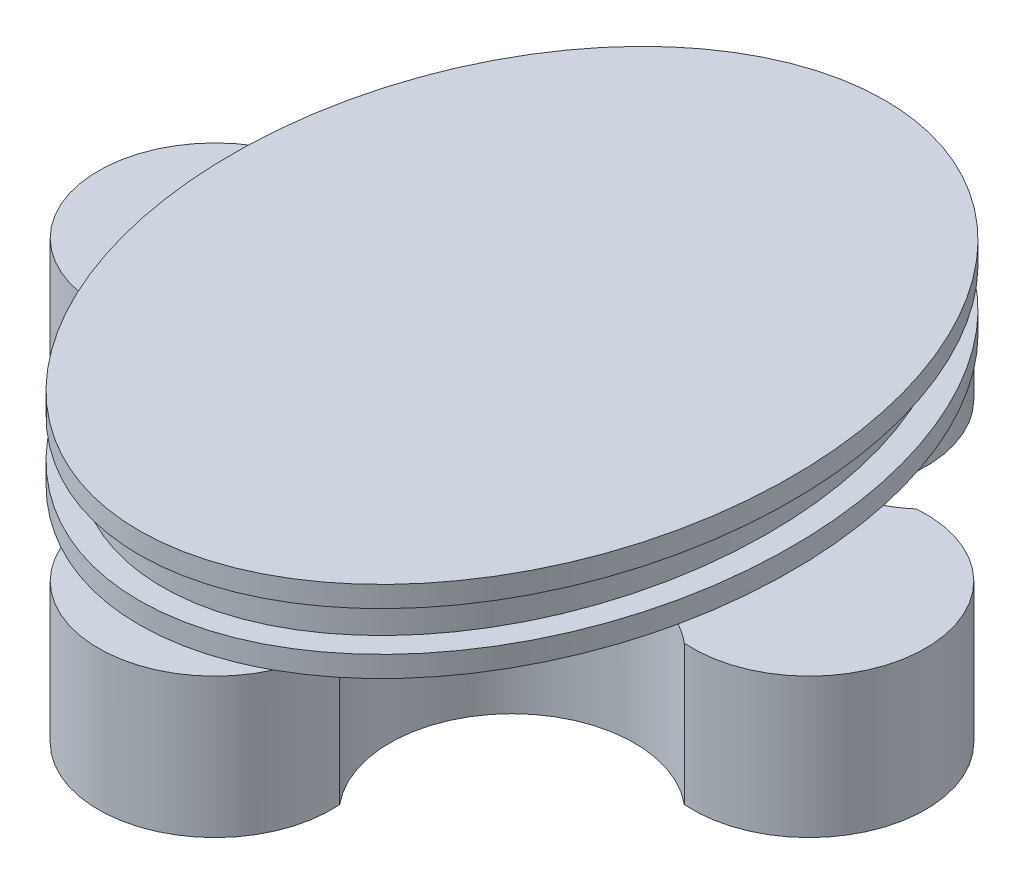
ISO-10303-21;
HEADER;
FILE_DESCRIPTION(('STEP AP214'),'2;1');
FILE_NAME('part.step','',(''),(''),'','','');
FILE_SCHEMA(('AUTOMOTIVE_DESIGN { 1 0 10303 214 1 1 1 1 }'));
ENDSEC;
DATA;
#1=APPLICATION_CONTEXT('core data for automotive mechanical design processes');
#2=APPLICATION_PROTOCOL_DEFINITION('international standard','automotive_design',2000,#1);
#3=PRODUCT_CONTEXT('',#1,'mechanical');
#4=PRODUCT('Part','Part','',(#3));
#5=PRODUCT_RELATED_PRODUCT_CATEGORY('part','',(#4));
#6=PRODUCT_DEFINITION_FORMATION('','',#4);
#7=PRODUCT_DEFINITION_CONTEXT('part definition',#1,'design');
#8=PRODUCT_DEFINITION('design','',#6,#7);
#9=PRODUCT_DEFINITION_SHAPE('','',#8);
#10=(LENGTH_UNIT() NAMED_UNIT(*) SI_UNIT(.MILLI.,.METRE.));
#11=(NAMED_UNIT(*) PLANE_ANGLE_UNIT() SI_UNIT($,.RADIAN.));
#12=(NAMED_UNIT(*) SI_UNIT($,.STERADIAN.) SOLID_ANGLE_UNIT());
#13=UNCERTAINTY_MEASURE_WITH_UNIT(LENGTH_MEASURE(1.E-05),#10,'distance_accuracy_value','');
#14=(GEOMETRIC_REPRESENTATION_CONTEXT(3) GLOBAL_UNCERTAINTY_ASSIGNED_CONTEXT((#13)) GLOBAL_UNIT_ASSIGNED_CONTEXT((#10,
#11,#12)) REPRESENTATION_CONTEXT('',''));
#15=CARTESIAN_POINT('',(0.,0.,0.));
#16=DIRECTION('',(0.,0.,1.));
#17=DIRECTION('',(1.,0.,0.));
#18=AXIS2_PLACEMENT_3D('',#15,#16,#17);
#19=CARTESIAN_POINT('',(0.,0.,0.));
#20=DIRECTION('',(0.,1.,0.));
#21=DIRECTION('',(0.,0.,1.));
#22=AXIS2_PLACEMENT_3D('',#19,#20,#21);
#23=PLANE('',#22);
#24=CARTESIAN_POINT('',(0.,0.,0.));
#25=DIRECTION('',(0.,1.,0.));
#26=DIRECTION('',(0.,0.,-1.));
#27=AXIS2_PLACEMENT_3D('',#24,#25,#26);
#28=ELLIPSE('',#27,16.,12.);
#29=CARTESIAN_POINT('',(-11.5350552187258,0.,4.41059353041869));
#30=VERTEX_POINT('',#29);
#31=CARTESIAN_POINT('',(-4.56069619587107,0.,14.799402402888));
#32=VERTEX_POINT('',#31);
#33=EDGE_CURVE('E251',#30,#32,#28,.T.);
#34=ORIENTED_EDGE('',*,*,#33,.F.);
#35=CARTESIAN_POINT('',(-9.01499999999982,0.,9.01622287878911));
#36=DIRECTION('',(0.,-1.,0.));
#37=DIRECTION('',(0.,0.,-1.));
#38=AXIS2_PLACEMENT_3D('',#35,#36,#37);
#39=CIRCLE('',#38,5.2499999999999);
#40=CARTESIAN_POINT('',(-4.9864961665555,0.,12.3827725760197));
#41=VERTEX_POINT('',#40);
#42=EDGE_CURVE('E53',#30,#41,#39,.T.);
#43=ORIENTED_EDGE('',*,*,#42,.T.);
#44=CARTESIAN_POINT('',(2.5381832073261E-13,0.,12.75));
#45=DIRECTION('',(0.,-1.,0.));
#46=DIRECTION('',(0.,0.,-1.));
#47=AXIS2_PLACEMENT_3D('',#44,#45,#46);
#48=CIRCLE('',#47,4.99999999999984);
#49=EDGE_CURVE('E204',#32,#41,#48,.T.);
#50=ORIENTED_EDGE('',*,*,#49,.F.);
#51=EDGE_LOOP('',(#34,#43,#50));
#52=FACE_BOUND('',#51,.T.);
#53=ADVANCED_FACE('F42',(#52),#23,.F.);
#54=CARTESIAN_POINT('',(0.,0.,-12.75));
#55=DIRECTION('',(0.,-1.,0.));
#56=DIRECTION('',(0.,0.,-1.));
#57=AXIS2_PLACEMENT_3D('',#54,#55,#56);
#58=CIRCLE('',#57,5.);
#59=CARTESIAN_POINT('',(-4.98627820309729,0.,-12.3798247964586));
#60=VERTEX_POINT('',#59);
#61=CARTESIAN_POINT('',(-4.56069619587164,0.,-14.7994024028877));
#62=VERTEX_POINT('',#61);
#63=EDGE_CURVE('E182',#60,#62,#58,.T.);
#64=ORIENTED_EDGE('',*,*,#63,.F.);
#65=CARTESIAN_POINT('',(-9.01622287878913,0.,-9.01499999999997));
#66=DIRECTION('',(0.,-1.,0.));
#67=DIRECTION('',(0.,0.,-1.));
#68=AXIS2_PLACEMENT_3D('',#65,#66,#67);
#69=CIRCLE('',#68,5.25);
#70=CARTESIAN_POINT('',(-11.5354192149795,0.,-4.40890080222699));
#71=VERTEX_POINT('',#70);
#72=EDGE_CURVE('E144',#60,#71,#69,.T.);
#73=ORIENTED_EDGE('',*,*,#72,.T.);
#74=EDGE_CURVE('E241',#62,#71,#28,.T.);
#75=ORIENTED_EDGE('',*,*,#74,.F.);
#76=EDGE_LOOP('',(#64,#73,#75));
#77=FACE_BOUND('',#76,.T.);
#78=ADVANCED_FACE('F307',(#77),#23,.F.);
#79=CARTESIAN_POINT('',(4.98627820309738,0.,12.3798247964586));
#80=VERTEX_POINT('',#79);
#81=CARTESIAN_POINT('',(4.56069619587174,0.,14.7994024028877));
#82=VERTEX_POINT('',#81);
#83=EDGE_CURVE('E199',#80,#82,#48,.T.);
#84=ORIENTED_EDGE('',*,*,#83,.F.);
#85=CARTESIAN_POINT('',(9.01622287878919,0.,9.01499999999991));
#86=DIRECTION('',(0.,-1.,0.));
#87=DIRECTION('',(0.,0.,-1.));
#88=AXIS2_PLACEMENT_3D('',#85,#86,#87);
#89=CIRCLE('',#88,5.25);
#90=CARTESIAN_POINT('',(11.5354192149795,0.,4.4089008022269));
#91=VERTEX_POINT('',#90);
#92=EDGE_CURVE('E194',#80,#91,#89,.T.);
#93=ORIENTED_EDGE('',*,*,#92,.T.);
#94=EDGE_CURVE('E262',#82,#91,#28,.T.);
#95=ORIENTED_EDGE('',*,*,#94,.F.);
#96=EDGE_LOOP('',(#84,#93,#95));
#97=FACE_BOUND('',#96,.T.);
#98=ADVANCED_FACE('F311',(#97),#23,.F.);
#99=CARTESIAN_POINT('',(0.,0.9,0.));
#100=DIRECTION('',(0.,1.,0.));
#101=DIRECTION('',(0.,0.,-1.));
#102=AXIS2_PLACEMENT_3D('',#99,#100,#101);
#103=ELLIPSE('',#102,16.,12.);
#104=DIRECTION('',(0.,-1.,0.));
#105=VECTOR('',#104,1.);
#106=SURFACE_OF_LINEAR_EXTRUSION('',#103,#105);
#107=CARTESIAN_POINT('',(0.,0.9,-16.));
#108=VERTEX_POINT('',#107);
#109=EDGE_CURVE('E237',#108,#108,#103,.T.);
#110=ORIENTED_EDGE('',*,*,#109,.F.);
#111=EDGE_LOOP('',(#110));
#112=FACE_BOUND('',#111,.T.);
#113=ORIENTED_EDGE('',*,*,#74,.T.);
#114=EDGE_CURVE('E244',#71,#30,#28,.T.);
#115=ORIENTED_EDGE('',*,*,#114,.T.);
#116=ORIENTED_EDGE('',*,*,#33,.T.);
#117=EDGE_CURVE('E266',#32,#82,#28,.T.);
#118=ORIENTED_EDGE('',*,*,#117,.T.);
#119=ORIENTED_EDGE('',*,*,#94,.T.);
#120=CARTESIAN_POINT('',(11.5350552187259,0.,-4.41059353041851));
#121=VERTEX_POINT('',#120);
#122=EDGE_CURVE('E257',#91,#121,#28,.T.);
#123=ORIENTED_EDGE('',*,*,#122,.T.);
#124=CARTESIAN_POINT('',(4.56069619587164,0.,-14.7994024028877));
#125=VERTEX_POINT('',#124);
#126=EDGE_CURVE('E253',#121,#125,#28,.T.);
#127=ORIENTED_EDGE('',*,*,#126,.T.);
#128=EDGE_CURVE('E152',#125,#62,#28,.T.);
#129=ORIENTED_EDGE('',*,*,#128,.T.);
#130=EDGE_LOOP('',(#113,#115,#116,#118,#119,#123,#127,#129));
#131=FACE_BOUND('',#130,.T.);
#132=ADVANCED_FACE('F44',(#112,#131),#106,.F.);
#133=CARTESIAN_POINT('',(0.,0.9,0.));
#134=DIRECTION('',(0.,1.,0.));
#135=DIRECTION('',(0.,0.,1.));
#136=AXIS2_PLACEMENT_3D('',#133,#134,#135);
#137=PLANE('',#136);
#138=CARTESIAN_POINT('',(0.,0.9,0.));
#139=DIRECTION('',(0.,1.,0.));
#140=DIRECTION('',(0.,0.,-1.));
#141=AXIS2_PLACEMENT_3D('',#138,#139,#140);
#142=ELLIPSE('',#141,15.,11.);
#143=CARTESIAN_POINT('',(0.,0.9,-15.));
#144=VERTEX_POINT('',#143);
#145=EDGE_CURVE('E11',#144,#144,#142,.T.);
#146=ORIENTED_EDGE('',*,*,#145,.F.);
#147=EDGE_LOOP('',(#146));
#148=FACE_BOUND('',#147,.T.);
#149=ORIENTED_EDGE('',*,*,#109,.T.);
#150=EDGE_LOOP('',(#149));
#151=FACE_BOUND('',#150,.T.);
#152=ADVANCED_FACE('F315',(#148,#151),#137,.T.);
#153=CARTESIAN_POINT('',(4.98649616655595,0.,-12.3827725760202));
#154=VERTEX_POINT('',#153);
#155=EDGE_CURVE('E150',#125,#154,#58,.T.);
#156=ORIENTED_EDGE('',*,*,#155,.F.);
#157=ORIENTED_EDGE('',*,*,#126,.F.);
#158=CARTESIAN_POINT('',(9.015,0.,-9.0162228787891));
#159=DIRECTION('',(0.,-1.,0.));
#160=DIRECTION('',(0.,0.,-1.));
#161=AXIS2_PLACEMENT_3D('',#158,#159,#160);
#162=CIRCLE('',#161,5.25);
#163=EDGE_CURVE('E66',#121,#154,#162,.T.);
#164=ORIENTED_EDGE('',*,*,#163,.T.);
#165=EDGE_LOOP('',(#156,#157,#164));
#166=FACE_BOUND('',#165,.T.);
#167=ADVANCED_FACE('F302',(#166),#23,.F.);
#168=CARTESIAN_POINT('',(0.,0.,0.));
#169=DIRECTION('',(0.,-1.,0.));
#170=DIRECTION('',(0.,0.,-1.));
#171=AXIS2_PLACEMENT_3D('',#168,#169,#170);
#172=PLANE('',#171);
#173=ORIENTED_EDGE('',*,*,#114,.F.);
#174=CARTESIAN_POINT('',(-12.3827725760202,0.,-4.9864961665559));
#175=VERTEX_POINT('',#174);
#176=EDGE_CURVE('E212',#71,#175,#69,.T.);
#177=ORIENTED_EDGE('',*,*,#176,.T.);
#178=CARTESIAN_POINT('',(-12.75,0.,0.));
#179=DIRECTION('',(0.,-1.,0.));
#180=DIRECTION('',(0.,0.,-1.));
#181=AXIS2_PLACEMENT_3D('',#178,#179,#180);
#182=CIRCLE('',#181,5.);
#183=CARTESIAN_POINT('',(-12.3798247964584,0.,4.98627820309731));
#184=VERTEX_POINT('',#183);
#185=EDGE_CURVE('E208',#184,#175,#182,.T.);
#186=ORIENTED_EDGE('',*,*,#185,.F.);
#187=EDGE_CURVE('E203',#184,#30,#39,.T.);
#188=ORIENTED_EDGE('',*,*,#187,.T.);
#189=EDGE_LOOP('',(#173,#177,#186,#188));
#190=FACE_BOUND('',#189,.T.);
#191=ADVANCED_FACE('F294',(#190),#172,.F.);
#192=ORIENTED_EDGE('',*,*,#117,.F.);
#193=EDGE_CURVE('E198',#82,#32,#48,.T.);
#194=ORIENTED_EDGE('',*,*,#193,.F.);
#195=EDGE_LOOP('',(#192,#194));
#196=FACE_BOUND('',#195,.T.);
#197=ADVANCED_FACE('F291',(#196),#172,.F.);
#198=ORIENTED_EDGE('',*,*,#122,.F.);
#199=CARTESIAN_POINT('',(12.3827725760202,0.,4.98649616655582));
#200=VERTEX_POINT('',#199);
#201=EDGE_CURVE('E193',#91,#200,#89,.T.);
#202=ORIENTED_EDGE('',*,*,#201,.T.);
#203=CARTESIAN_POINT('',(12.75,0.,-1.3354916121075E-13));
#204=DIRECTION('',(0.,-1.,0.));
#205=DIRECTION('',(0.,0.,-1.));
#206=AXIS2_PLACEMENT_3D('',#203,#204,#205);
#207=CIRCLE('',#206,5.);
#208=CARTESIAN_POINT('',(12.3798247964589,0.,-4.98627820309744));
#209=VERTEX_POINT('',#208);
#210=EDGE_CURVE('E189',#209,#200,#207,.T.);
#211=ORIENTED_EDGE('',*,*,#210,.F.);
#212=EDGE_CURVE('E185',#209,#121,#162,.T.);
#213=ORIENTED_EDGE('',*,*,#212,.T.);
#214=EDGE_LOOP('',(#198,#202,#211,#213));
#215=FACE_BOUND('',#214,.T.);
#216=ADVANCED_FACE('F293',(#215),#172,.F.);
#217=CARTESIAN_POINT('',(0.,-6.,-12.75));
#218=DIRECTION('',(0.,1.,0.));
#219=DIRECTION('',(0.,0.,1.));
#220=AXIS2_PLACEMENT_3D('',#217,#218,#219);
#221=CYLINDRICAL_SURFACE('',#220,5.);
#222=ORIENTED_EDGE('',*,*,#63,.T.);
#223=EDGE_CURVE('E186',#62,#125,#58,.T.);
#224=ORIENTED_EDGE('',*,*,#223,.T.);
#225=ORIENTED_EDGE('',*,*,#155,.T.);
#226=DIRECTION('',(0.,1.,0.));
#227=VECTOR('',#226,1.);
#228=CARTESIAN_POINT('',(4.98649616655595,-6.,-12.3827725760202));
#229=LINE('',#228,#227);
#230=CARTESIAN_POINT('',(4.98649616655595,-6.,-12.3827725760202));
#231=VERTEX_POINT('',#230);
#232=EDGE_CURVE('E61',#231,#154,#229,.T.);
#233=ORIENTED_EDGE('',*,*,#232,.F.);
#234=CARTESIAN_POINT('',(0.,-6.,-12.75));
#235=DIRECTION('',(0.,-1.,0.));
#236=DIRECTION('',(0.,0.,-1.));
#237=AXIS2_PLACEMENT_3D('',#234,#235,#236);
#238=CIRCLE('',#237,5.);
#239=CARTESIAN_POINT('',(-4.98627820309729,-6.,-12.3798247964586));
#240=VERTEX_POINT('',#239);
#241=EDGE_CURVE('E137',#240,#231,#238,.T.);
#242=ORIENTED_EDGE('',*,*,#241,.F.);
#243=DIRECTION('',(0.,1.,0.));
#244=VECTOR('',#243,1.);
#245=CARTESIAN_POINT('',(-4.98627820309729,-6.,-12.3798247964586));
#246=LINE('',#245,#244);
#247=EDGE_CURVE('E181',#240,#60,#246,.T.);
#248=ORIENTED_EDGE('',*,*,#247,.T.);
#249=EDGE_LOOP('',(#222,#224,#225,#233,#242,#248));
#250=FACE_BOUND('',#249,.T.);
#251=ADVANCED_FACE('F147',(#250),#221,.T.);
#252=CARTESIAN_POINT('',(9.015,-6.,-9.0162228787891));
#253=DIRECTION('',(0.,1.,0.));
#254=DIRECTION('',(0.,0.,1.));
#255=AXIS2_PLACEMENT_3D('',#252,#253,#254);
#256=CYLINDRICAL_SURFACE('',#255,5.25);
#257=ORIENTED_EDGE('',*,*,#212,.F.);
#258=DIRECTION('',(0.,1.,0.));
#259=VECTOR('',#258,1.);
#260=CARTESIAN_POINT('',(12.3798247964589,-6.,-4.98627820309744));
#261=LINE('',#260,#259);
#262=CARTESIAN_POINT('',(12.3798247964589,-6.,-4.98627820309744));
#263=VERTEX_POINT('',#262);
#264=EDGE_CURVE('E153',#263,#209,#261,.T.);
#265=ORIENTED_EDGE('',*,*,#264,.F.);
#266=CARTESIAN_POINT('',(9.015,-6.,-9.0162228787891));
#267=DIRECTION('',(0.,-1.,0.));
#268=DIRECTION('',(0.,0.,-1.));
#269=AXIS2_PLACEMENT_3D('',#266,#267,#268);
#270=CIRCLE('',#269,5.25);
#271=EDGE_CURVE('E139',#263,#231,#270,.T.);
#272=ORIENTED_EDGE('',*,*,#271,.T.);
#273=ORIENTED_EDGE('',*,*,#232,.T.);
#274=ORIENTED_EDGE('',*,*,#163,.F.);
#275=EDGE_LOOP('',(#257,#265,#272,#273,#274));
#276=FACE_BOUND('',#275,.T.);
#277=ADVANCED_FACE('F155',(#276),#256,.F.);
#278=CARTESIAN_POINT('',(12.75,-6.,-1.3354916121075E-13));
#279=DIRECTION('',(0.,1.,0.));
#280=DIRECTION('',(0.,0.,1.));
#281=AXIS2_PLACEMENT_3D('',#278,#279,#280);
#282=CYLINDRICAL_SURFACE('',#281,5.);
#283=ORIENTED_EDGE('',*,*,#210,.T.);
#284=DIRECTION('',(0.,1.,0.));
#285=VECTOR('',#284,1.);
#286=CARTESIAN_POINT('',(12.3827725760202,-6.,4.98649616655582));
#287=LINE('',#286,#285);
#288=CARTESIAN_POINT('',(12.3827725760202,-6.,4.98649616655582));
#289=VERTEX_POINT('',#288);
#290=EDGE_CURVE('E232',#289,#200,#287,.T.);
#291=ORIENTED_EDGE('',*,*,#290,.F.);
#292=CARTESIAN_POINT('',(12.75,-6.,-1.3354916121075E-13));
#293=DIRECTION('',(0.,-1.,0.));
#294=DIRECTION('',(0.,0.,-1.));
#295=AXIS2_PLACEMENT_3D('',#292,#293,#294);
#296=CIRCLE('',#295,5.);
#297=EDGE_CURVE('E158',#263,#289,#296,.T.);
#298=ORIENTED_EDGE('',*,*,#297,.F.);
#299=ORIENTED_EDGE('',*,*,#264,.T.);
#300=EDGE_LOOP('',(#283,#291,#298,#299));
#301=FACE_BOUND('',#300,.T.);
#302=ADVANCED_FACE('F516',(#301),#282,.T.);
#303=CARTESIAN_POINT('',(9.01622287878919,-6.,9.01499999999991));
#304=DIRECTION('',(0.,1.,0.));
#305=DIRECTION('',(0.,0.,1.));
#306=AXIS2_PLACEMENT_3D('',#303,#304,#305);
#307=CYLINDRICAL_SURFACE('',#306,5.25);
#308=ORIENTED_EDGE('',*,*,#92,.F.);
#309=DIRECTION('',(0.,1.,0.));
#310=VECTOR('',#309,1.);
#311=CARTESIAN_POINT('',(4.98627820309738,-6.,12.3798247964586));
#312=LINE('',#311,#310);
#313=CARTESIAN_POINT('',(4.98627820309738,-6.,12.3798247964586));
#314=VERTEX_POINT('',#313);
#315=EDGE_CURVE('E229',#314,#80,#312,.T.);
#316=ORIENTED_EDGE('',*,*,#315,.F.);
#317=CARTESIAN_POINT('',(9.01622287878919,-6.,9.01499999999991));
#318=DIRECTION('',(0.,-1.,0.));
#319=DIRECTION('',(0.,0.,-1.));
#320=AXIS2_PLACEMENT_3D('',#317,#318,#319);
#321=CIRCLE('',#320,5.25);
#322=EDGE_CURVE('E162',#314,#289,#321,.T.);
#323=ORIENTED_EDGE('',*,*,#322,.T.);
#324=ORIENTED_EDGE('',*,*,#290,.T.);
#325=ORIENTED_EDGE('',*,*,#201,.F.);
#326=EDGE_LOOP('',(#308,#316,#323,#324,#325));
#327=FACE_BOUND('',#326,.T.);
#328=ADVANCED_FACE('F330',(#327),#307,.F.);
#329=CARTESIAN_POINT('',(2.5381832073261E-13,-6.,12.75));
#330=DIRECTION('',(0.,1.,0.));
#331=DIRECTION('',(0.,0.,1.));
#332=AXIS2_PLACEMENT_3D('',#329,#330,#331);
#333=CYLINDRICAL_SURFACE('',#332,4.99999999999984);
#334=ORIENTED_EDGE('',*,*,#83,.T.);
#335=ORIENTED_EDGE('',*,*,#193,.T.);
#336=ORIENTED_EDGE('',*,*,#49,.T.);
#337=DIRECTION('',(0.,1.,0.));
#338=VECTOR('',#337,1.);
#339=CARTESIAN_POINT('',(-4.9864961665555,-6.,12.3827725760197));
#340=LINE('',#339,#338);
#341=CARTESIAN_POINT('',(-4.9864961665555,-6.,12.3827725760197));
#342=VERTEX_POINT('',#341);
#343=EDGE_CURVE('E225',#342,#41,#340,.T.);
#344=ORIENTED_EDGE('',*,*,#343,.F.);
#345=CARTESIAN_POINT('',(2.5381832073261E-13,-6.,12.75));
#346=DIRECTION('',(0.,-1.,0.));
#347=DIRECTION('',(0.,0.,-1.));
#348=AXIS2_PLACEMENT_3D('',#345,#346,#347);
#349=CIRCLE('',#348,4.99999999999984);
#350=EDGE_CURVE('E169',#314,#342,#349,.T.);
#351=ORIENTED_EDGE('',*,*,#350,.F.);
#352=ORIENTED_EDGE('',*,*,#315,.T.);
#353=EDGE_LOOP('',(#334,#335,#336,#344,#351,#352));
#354=FACE_BOUND('',#353,.T.);
#355=ADVANCED_FACE('F288',(#354),#333,.T.);
#356=CARTESIAN_POINT('',(-9.01499999999982,-6.,9.01622287878911));
#357=DIRECTION('',(0.,1.,0.));
#358=DIRECTION('',(0.,0.,1.));
#359=AXIS2_PLACEMENT_3D('',#356,#357,#358);
#360=CYLINDRICAL_SURFACE('',#359,5.2499999999999);
#361=ORIENTED_EDGE('',*,*,#187,.F.);
#362=DIRECTION('',(0.,1.,0.));
#363=VECTOR('',#362,1.);
#364=CARTESIAN_POINT('',(-12.3798247964584,-6.,4.98627820309731));
#365=LINE('',#364,#363);
#366=CARTESIAN_POINT('',(-12.3798247964584,-6.,4.98627820309731));
#367=VERTEX_POINT('',#366);
#368=EDGE_CURVE('E222',#367,#184,#365,.T.);
#369=ORIENTED_EDGE('',*,*,#368,.F.);
#370=CARTESIAN_POINT('',(-9.01499999999982,-6.,9.01622287878911));
#371=DIRECTION('',(0.,-1.,0.));
#372=DIRECTION('',(0.,0.,-1.));
#373=AXIS2_PLACEMENT_3D('',#370,#371,#372);
#374=CIRCLE('',#373,5.2499999999999);
#375=EDGE_CURVE('E172',#367,#342,#374,.T.);
#376=ORIENTED_EDGE('',*,*,#375,.T.);
#377=ORIENTED_EDGE('',*,*,#343,.T.);
#378=ORIENTED_EDGE('',*,*,#42,.F.);
#379=EDGE_LOOP('',(#361,#369,#376,#377,#378));
#380=FACE_BOUND('',#379,.T.);
#381=ADVANCED_FACE('F486',(#380),#360,.F.);
#382=CARTESIAN_POINT('',(-12.75,-6.,0.));
#383=DIRECTION('',(0.,1.,0.));
#384=DIRECTION('',(0.,0.,1.));
#385=AXIS2_PLACEMENT_3D('',#382,#383,#384);
#386=CYLINDRICAL_SURFACE('',#385,5.);
#387=ORIENTED_EDGE('',*,*,#185,.T.);
#388=DIRECTION('',(0.,1.,0.));
#389=VECTOR('',#388,1.);
#390=CARTESIAN_POINT('',(-12.3827725760202,-6.,-4.9864961665559));
#391=LINE('',#390,#389);
#392=CARTESIAN_POINT('',(-12.3827725760202,-6.,-4.9864961665559));
#393=VERTEX_POINT('',#392);
#394=EDGE_CURVE('E218',#393,#175,#391,.T.);
#395=ORIENTED_EDGE('',*,*,#394,.F.);
#396=CARTESIAN_POINT('',(-12.75,-6.,0.));
#397=DIRECTION('',(0.,-1.,0.));
#398=DIRECTION('',(0.,0.,-1.));
#399=AXIS2_PLACEMENT_3D('',#396,#397,#398);
#400=CIRCLE('',#399,5.);
#401=EDGE_CURVE('E176',#367,#393,#400,.T.);
#402=ORIENTED_EDGE('',*,*,#401,.F.);
#403=ORIENTED_EDGE('',*,*,#368,.T.);
#404=EDGE_LOOP('',(#387,#395,#402,#403));
#405=FACE_BOUND('',#404,.T.);
#406=ADVANCED_FACE('F387',(#405),#386,.T.);
#407=CARTESIAN_POINT('',(-9.01622287878913,-6.,-9.01499999999997));
#408=DIRECTION('',(0.,1.,0.));
#409=DIRECTION('',(0.,0.,1.));
#410=AXIS2_PLACEMENT_3D('',#407,#408,#409);
#411=CYLINDRICAL_SURFACE('',#410,5.25);
#412=ORIENTED_EDGE('',*,*,#72,.F.);
#413=ORIENTED_EDGE('',*,*,#247,.F.);
#414=CARTESIAN_POINT('',(-9.01622287878913,-6.,-9.01499999999997));
#415=DIRECTION('',(0.,-1.,0.));
#416=DIRECTION('',(0.,0.,-1.));
#417=AXIS2_PLACEMENT_3D('',#414,#415,#416);
#418=CIRCLE('',#417,5.25);
#419=EDGE_CURVE('E141',#240,#393,#418,.T.);
#420=ORIENTED_EDGE('',*,*,#419,.T.);
#421=ORIENTED_EDGE('',*,*,#394,.T.);
#422=ORIENTED_EDGE('',*,*,#176,.F.);
#423=EDGE_LOOP('',(#412,#413,#420,#421,#422));
#424=FACE_BOUND('',#423,.T.);
#425=ADVANCED_FACE('F380',(#424),#411,.F.);
#426=CARTESIAN_POINT('',(0.,-6.,0.));
#427=DIRECTION('',(0.,-1.,0.));
#428=DIRECTION('',(0.,0.,-1.));
#429=AXIS2_PLACEMENT_3D('',#426,#427,#428);
#430=PLANE('',#429);
#431=CARTESIAN_POINT('',(0.,-6.,0.));
#432=DIRECTION('',(0.,-1.,0.));
#433=DIRECTION('',(0.,0.,-1.));
#434=AXIS2_PLACEMENT_3D('',#431,#432,#433);
#435=CIRCLE('',#434,3.);
#436=CARTESIAN_POINT('',(0.,-6.,-3.));
#437=VERTEX_POINT('',#436);
#438=EDGE_CURVE('E47',#437,#437,#435,.T.);
#439=ORIENTED_EDGE('',*,*,#438,.F.);
#440=EDGE_LOOP('',(#439));
#441=FACE_BOUND('',#440,.T.);
#442=ORIENTED_EDGE('',*,*,#241,.T.);
#443=ORIENTED_EDGE('',*,*,#271,.F.);
#444=ORIENTED_EDGE('',*,*,#297,.T.);
#445=ORIENTED_EDGE('',*,*,#322,.F.);
#446=ORIENTED_EDGE('',*,*,#350,.T.);
#447=ORIENTED_EDGE('',*,*,#375,.F.);
#448=ORIENTED_EDGE('',*,*,#401,.T.);
#449=ORIENTED_EDGE('',*,*,#419,.F.);
#450=EDGE_LOOP('',(#442,#443,#444,#445,#446,#447,#448,#449));
#451=FACE_BOUND('',#450,.T.);
#452=ADVANCED_FACE('F138',(#441,#451),#430,.T.);
#453=ORIENTED_EDGE('',*,*,#128,.F.);
#454=ORIENTED_EDGE('',*,*,#223,.F.);
#455=EDGE_LOOP('',(#453,#454));
#456=FACE_BOUND('',#455,.T.);
#457=ADVANCED_FACE('F301',(#456),#172,.F.);
#458=CARTESIAN_POINT('',(0.,-9.1,0.));
#459=DIRECTION('',(0.,1.,0.));
#460=DIRECTION('',(0.,0.,1.));
#461=AXIS2_PLACEMENT_3D('',#458,#459,#460);
#462=CYLINDRICAL_SURFACE('',#461,3.);
#463=ORIENTED_EDGE('',*,*,#438,.T.);
#464=EDGE_LOOP('',(#463));
#465=FACE_BOUND('',#464,.T.);
#466=CARTESIAN_POINT('',(0.,0.9,0.));
#467=DIRECTION('',(0.,1.,0.));
#468=DIRECTION('',(0.,0.,1.));
#469=AXIS2_PLACEMENT_3D('',#466,#467,#468);
#470=CIRCLE('',#469,3.);
#471=CARTESIAN_POINT('',(0.,0.9,3.));
#472=VERTEX_POINT('',#471);
#473=EDGE_CURVE('E346',#472,#472,#470,.T.);
#474=ORIENTED_EDGE('',*,*,#473,.T.);
#475=EDGE_LOOP('',(#474));
#476=FACE_BOUND('',#475,.T.);
#477=ADVANCED_FACE('F374',(#465,#476),#462,.F.);
#478=CARTESIAN_POINT('',(0.,2.6,0.));
#479=DIRECTION('',(0.,1.,0.));
#480=DIRECTION('',(0.,0.,-1.));
#481=AXIS2_PLACEMENT_3D('',#478,#479,#480);
#482=ELLIPSE('',#481,15.,11.);
#483=DIRECTION('',(0.,-1.,0.));
#484=VECTOR('',#483,1.);
#485=SURFACE_OF_LINEAR_EXTRUSION('',#482,#484);
#486=CARTESIAN_POINT('',(0.,2.6,-15.));
#487=VERTEX_POINT('',#486);
#488=EDGE_CURVE('E350',#487,#487,#482,.T.);
#489=ORIENTED_EDGE('',*,*,#488,.F.);
#490=EDGE_LOOP('',(#489));
#491=FACE_BOUND('',#490,.T.);
#492=ORIENTED_EDGE('',*,*,#145,.T.);
#493=EDGE_LOOP('',(#492));
#494=FACE_BOUND('',#493,.T.);
#495=ADVANCED_FACE('F369',(#491,#494),#485,.F.);
#496=CARTESIAN_POINT('',(0.,0.9,0.));
#497=DIRECTION('',(0.,1.,0.));
#498=DIRECTION('',(0.,0.,1.));
#499=AXIS2_PLACEMENT_3D('',#496,#497,#498);
#500=PLANE('',#499);
#501=ORIENTED_EDGE('',*,*,#473,.F.);
#502=EDGE_LOOP('',(#501));
#503=FACE_BOUND('',#502,.T.);
#504=ADVANCED_FACE('F373',(#503),#500,.F.);
#505=CARTESIAN_POINT('',(0.,3.5,0.));
#506=DIRECTION('',(0.,1.,0.));
#507=DIRECTION('',(0.,0.,-1.));
#508=AXIS2_PLACEMENT_3D('',#505,#506,#507);
#509=ELLIPSE('',#508,16.,12.);
#510=DIRECTION('',(0.,-1.,0.));
#511=VECTOR('',#510,1.);
#512=SURFACE_OF_LINEAR_EXTRUSION('',#509,#511);
#513=CARTESIAN_POINT('',(0.,3.5,-16.));
#514=VERTEX_POINT('',#513);
#515=EDGE_CURVE('E354',#514,#514,#509,.T.);
#516=ORIENTED_EDGE('',*,*,#515,.F.);
#517=EDGE_LOOP('',(#516));
#518=FACE_BOUND('',#517,.T.);
#519=CARTESIAN_POINT('',(0.,2.6,0.));
#520=DIRECTION('',(0.,1.,0.));
#521=DIRECTION('',(0.,0.,-1.));
#522=AXIS2_PLACEMENT_3D('',#519,#520,#521);
#523=ELLIPSE('',#522,16.,12.);
#524=CARTESIAN_POINT('',(0.,2.6,-16.));
#525=VERTEX_POINT('',#524);
#526=EDGE_CURVE('E359',#525,#525,#523,.T.);
#527=ORIENTED_EDGE('',*,*,#526,.T.);
#528=EDGE_LOOP('',(#527));
#529=FACE_BOUND('',#528,.T.);
#530=ADVANCED_FACE('F394',(#518,#529),#512,.F.);
#531=CARTESIAN_POINT('',(0.,3.5,0.));
#532=DIRECTION('',(0.,1.,0.));
#533=DIRECTION('',(0.,0.,1.));
#534=AXIS2_PLACEMENT_3D('',#531,#532,#533);
#535=PLANE('',#534);
#536=ORIENTED_EDGE('',*,*,#515,.T.);
#537=EDGE_LOOP('',(#536));
#538=FACE_BOUND('',#537,.T.);
#539=ADVANCED_FACE('F398',(#538),#535,.T.);
#540=CARTESIAN_POINT('',(0.,2.6,0.));
#541=DIRECTION('',(0.,1.,0.));
#542=DIRECTION('',(0.,0.,1.));
#543=AXIS2_PLACEMENT_3D('',#540,#541,#542);
#544=PLANE('',#543);
#545=ORIENTED_EDGE('',*,*,#488,.T.);
#546=EDGE_LOOP('',(#545));
#547=FACE_BOUND('',#546,.T.);
#548=ORIENTED_EDGE('',*,*,#526,.F.);
#549=EDGE_LOOP('',(#548));
#550=FACE_BOUND('',#549,.T.);
#551=ADVANCED_FACE('F403',(#547,#550),#544,.F.);
#552=CLOSED_SHELL('',(#53,#78,#98,#132,#152,#167,#191,#197,#216,#251,#277,#302,#328,#355,#381,
#406,#425,#452,#457,#477,#495,#504,#530,#539,#551));
#553=MANIFOLD_SOLID_BREP('B2',#552);
#554=ADVANCED_BREP_SHAPE_REPRESENTATION('',(#18,#553),#14);
#555=SHAPE_DEFINITION_REPRESENTATION(#9,#554);
ENDSEC;
END-ISO-10303-21;
